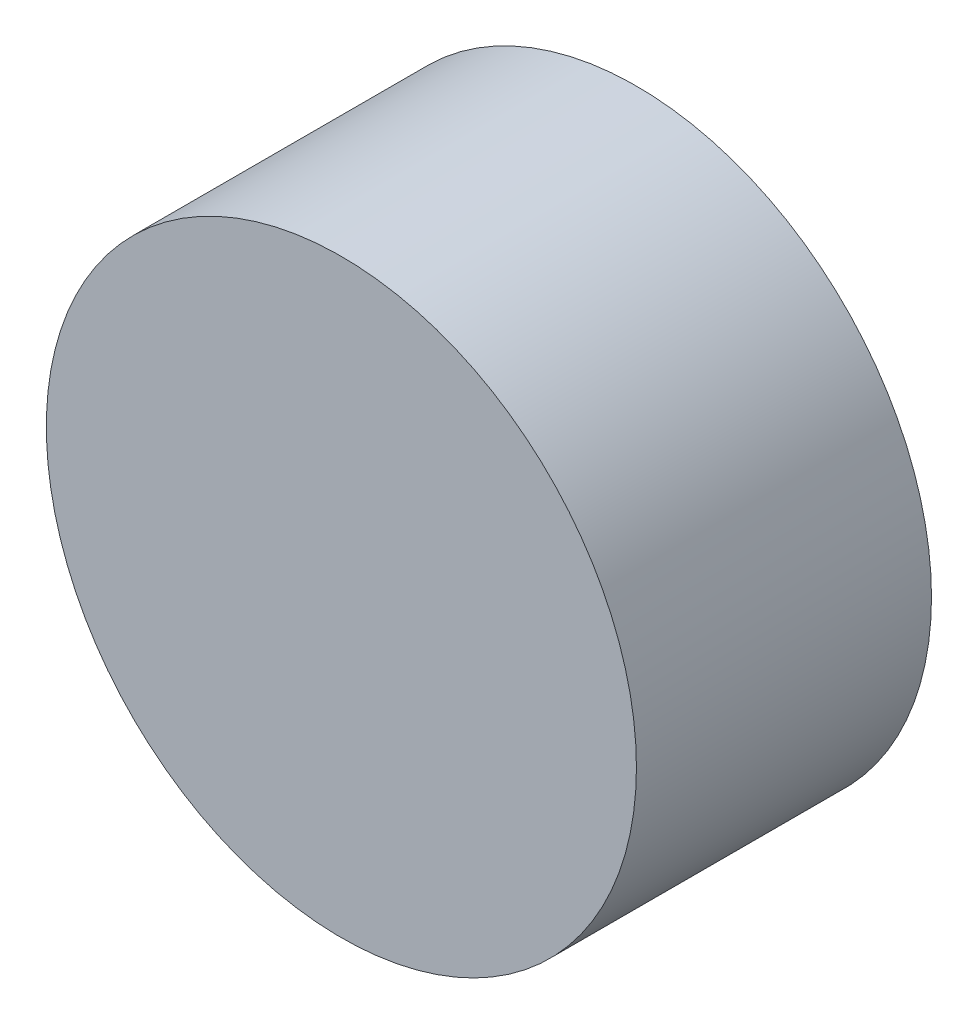
ISO-10303-21;
HEADER;
FILE_DESCRIPTION(('STEP AP214'),'2;1');
FILE_NAME('part.step','',(''),(''),'','','');
FILE_SCHEMA(('AUTOMOTIVE_DESIGN { 1 0 10303 214 1 1 1 1 }'));
ENDSEC;
DATA;
#1=APPLICATION_CONTEXT('core data for automotive mechanical design processes');
#2=APPLICATION_PROTOCOL_DEFINITION('international standard','automotive_design',2000,#1);
#3=PRODUCT_CONTEXT('',#1,'mechanical');
#4=PRODUCT('Part','Part','',(#3));
#5=PRODUCT_RELATED_PRODUCT_CATEGORY('part','',(#4));
#6=PRODUCT_DEFINITION_FORMATION('','',#4);
#7=PRODUCT_DEFINITION_CONTEXT('part definition',#1,'design');
#8=PRODUCT_DEFINITION('design','',#6,#7);
#9=PRODUCT_DEFINITION_SHAPE('','',#8);
#10=(LENGTH_UNIT() NAMED_UNIT(*) SI_UNIT(.MILLI.,.METRE.));
#11=(NAMED_UNIT(*) PLANE_ANGLE_UNIT() SI_UNIT($,.RADIAN.));
#12=(NAMED_UNIT(*) SI_UNIT($,.STERADIAN.) SOLID_ANGLE_UNIT());
#13=UNCERTAINTY_MEASURE_WITH_UNIT(LENGTH_MEASURE(1.E-05),#10,'distance_accuracy_value','');
#14=(GEOMETRIC_REPRESENTATION_CONTEXT(3) GLOBAL_UNCERTAINTY_ASSIGNED_CONTEXT((#13)) GLOBAL_UNIT_ASSIGNED_CONTEXT((#10,
#11,#12)) REPRESENTATION_CONTEXT('',''));
#15=CARTESIAN_POINT('',(0.,0.,0.));
#16=DIRECTION('',(0.,0.,1.));
#17=DIRECTION('',(1.,0.,0.));
#18=AXIS2_PLACEMENT_3D('',#15,#16,#17);
#19=CARTESIAN_POINT('',(0.,0.,8.89));
#20=DIRECTION('',(0.,0.,-1.));
#21=DIRECTION('',(-1.,0.,0.));
#22=AXIS2_PLACEMENT_3D('',#19,#20,#21);
#23=CYLINDRICAL_SURFACE('',#22,8.89);
#24=CARTESIAN_POINT('',(0.,0.,8.89));
#25=DIRECTION('',(0.,0.,1.));
#26=DIRECTION('',(1.,0.,0.));
#27=AXIS2_PLACEMENT_3D('',#24,#25,#26);
#28=CIRCLE('',#27,8.89);
#29=CARTESIAN_POINT('',(8.89,0.,8.89));
#30=VERTEX_POINT('',#29);
#31=EDGE_CURVE('E10',#30,#30,#28,.T.);
#32=ORIENTED_EDGE('',*,*,#31,.F.);
#33=EDGE_LOOP('',(#32));
#34=FACE_BOUND('',#33,.T.);
#35=CARTESIAN_POINT('',(0.,0.,0.));
#36=DIRECTION('',(0.,0.,1.));
#37=DIRECTION('',(1.,0.,0.));
#38=AXIS2_PLACEMENT_3D('',#35,#36,#37);
#39=CIRCLE('',#38,8.89);
#40=CARTESIAN_POINT('',(8.89,0.,0.));
#41=VERTEX_POINT('',#40);
#42=EDGE_CURVE('E38',#41,#41,#39,.T.);
#43=ORIENTED_EDGE('',*,*,#42,.T.);
#44=EDGE_LOOP('',(#43));
#45=FACE_BOUND('',#44,.T.);
#46=ADVANCED_FACE('F35',(#34,#45),#23,.T.);
#47=CARTESIAN_POINT('',(0.,0.,8.89));
#48=DIRECTION('',(0.,0.,1.));
#49=DIRECTION('',(1.,0.,0.));
#50=AXIS2_PLACEMENT_3D('',#47,#48,#49);
#51=PLANE('',#50);
#52=ORIENTED_EDGE('',*,*,#31,.T.);
#53=EDGE_LOOP('',(#52));
#54=FACE_BOUND('',#53,.T.);
#55=ADVANCED_FACE('F50',(#54),#51,.T.);
#56=CARTESIAN_POINT('',(0.,0.,0.));
#57=DIRECTION('',(0.,0.,1.));
#58=DIRECTION('',(1.,0.,0.));
#59=AXIS2_PLACEMENT_3D('',#56,#57,#58);
#60=PLANE('',#59);
#61=ORIENTED_EDGE('',*,*,#42,.F.);
#62=EDGE_LOOP('',(#61));
#63=FACE_BOUND('',#62,.T.);
#64=ADVANCED_FACE('F48',(#63),#60,.F.);
#65=CLOSED_SHELL('',(#46,#55,#64));
#66=MANIFOLD_SOLID_BREP('B2',#65);
#67=ADVANCED_BREP_SHAPE_REPRESENTATION('',(#18,#66),#14);
#68=SHAPE_DEFINITION_REPRESENTATION(#9,#67);
ENDSEC;
END-ISO-10303-21;
